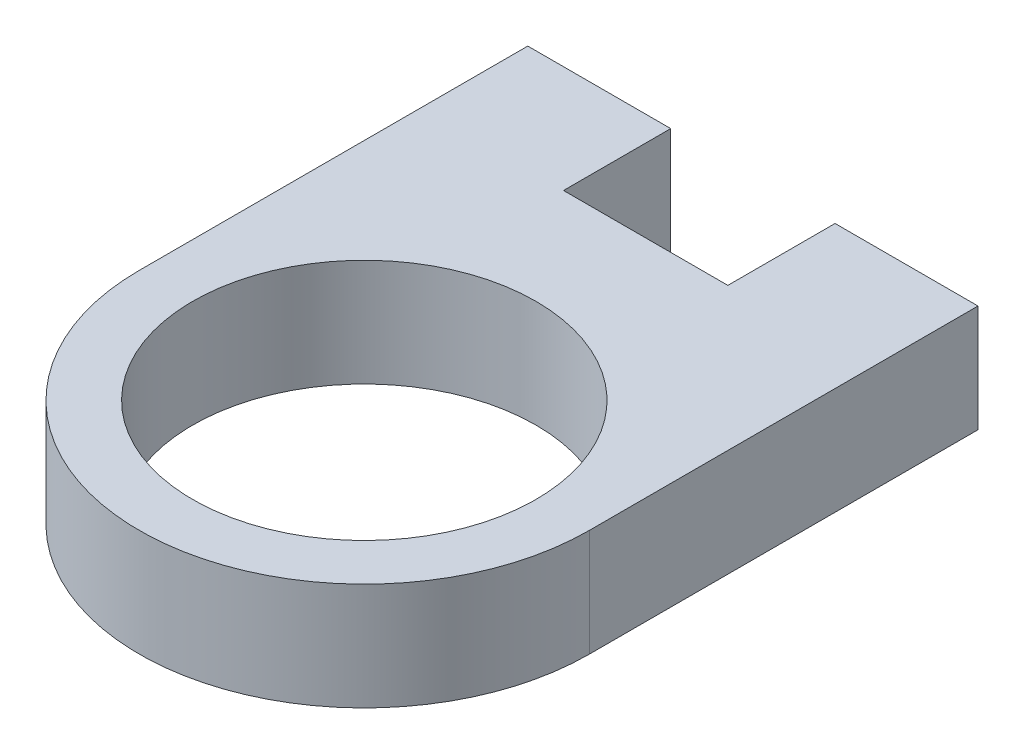
ISO-10303-21;
HEADER;
FILE_DESCRIPTION(('STEP AP214'),'2;1');
FILE_NAME('part.step','',(''),(''),'','','');
FILE_SCHEMA(('AUTOMOTIVE_DESIGN { 1 0 10303 214 1 1 1 1 }'));
ENDSEC;
DATA;
#1=APPLICATION_CONTEXT('core data for automotive mechanical design processes');
#2=APPLICATION_PROTOCOL_DEFINITION('international standard','automotive_design',2000,#1);
#3=PRODUCT_CONTEXT('',#1,'mechanical');
#4=PRODUCT('Part','Part','',(#3));
#5=PRODUCT_RELATED_PRODUCT_CATEGORY('part','',(#4));
#6=PRODUCT_DEFINITION_FORMATION('','',#4);
#7=PRODUCT_DEFINITION_CONTEXT('part definition',#1,'design');
#8=PRODUCT_DEFINITION('design','',#6,#7);
#9=PRODUCT_DEFINITION_SHAPE('','',#8);
#10=(LENGTH_UNIT() NAMED_UNIT(*) SI_UNIT(.MILLI.,.METRE.));
#11=(NAMED_UNIT(*) PLANE_ANGLE_UNIT() SI_UNIT($,.RADIAN.));
#12=(NAMED_UNIT(*) SI_UNIT($,.STERADIAN.) SOLID_ANGLE_UNIT());
#13=UNCERTAINTY_MEASURE_WITH_UNIT(LENGTH_MEASURE(1.E-05),#10,'distance_accuracy_value','');
#14=(GEOMETRIC_REPRESENTATION_CONTEXT(3) GLOBAL_UNCERTAINTY_ASSIGNED_CONTEXT((#13)) GLOBAL_UNIT_ASSIGNED_CONTEXT((#10,
#11,#12)) REPRESENTATION_CONTEXT('',''));
#15=CARTESIAN_POINT('',(0.,0.,0.));
#16=DIRECTION('',(0.,0.,1.));
#17=DIRECTION('',(1.,0.,0.));
#18=AXIS2_PLACEMENT_3D('',#15,#16,#17);
#19=CARTESIAN_POINT('',(0.,7.62,-20.));
#20=DIRECTION('',(0.,0.,-1.));
#21=DIRECTION('',(-1.,0.,0.));
#22=AXIS2_PLACEMENT_3D('',#19,#20,#21);
#23=PLANE('',#22);
#24=DIRECTION('',(1.,0.,0.));
#25=VECTOR('',#24,1.);
#26=CARTESIAN_POINT('',(0.,0.,-20.));
#27=LINE('',#26,#25);
#28=CARTESIAN_POINT('',(10.16,0.,-20.));
#29=VERTEX_POINT('',#28);
#30=CARTESIAN_POINT('',(21.84,0.,-20.));
#31=VERTEX_POINT('',#30);
#32=EDGE_CURVE('E65',#29,#31,#27,.T.);
#33=ORIENTED_EDGE('',*,*,#32,.F.);
#34=DIRECTION('',(0.,-1.,0.));
#35=VECTOR('',#34,1.);
#36=CARTESIAN_POINT('',(10.16,7.62,-20.));
#37=LINE('',#36,#35);
#38=CARTESIAN_POINT('',(10.16,7.62,-20.));
#39=VERTEX_POINT('',#38);
#40=EDGE_CURVE('E134',#39,#29,#37,.T.);
#41=ORIENTED_EDGE('',*,*,#40,.F.);
#42=DIRECTION('',(1.,0.,0.));
#43=VECTOR('',#42,1.);
#44=CARTESIAN_POINT('',(0.,7.62,-20.));
#45=LINE('',#44,#43);
#46=CARTESIAN_POINT('',(21.84,7.62,-20.));
#47=VERTEX_POINT('',#46);
#48=EDGE_CURVE('E120',#39,#47,#45,.T.);
#49=ORIENTED_EDGE('',*,*,#48,.T.);
#50=DIRECTION('',(0.,1.,0.));
#51=VECTOR('',#50,1.);
#52=CARTESIAN_POINT('',(21.84,7.62,-20.));
#53=LINE('',#52,#51);
#54=EDGE_CURVE('E142',#31,#47,#53,.T.);
#55=ORIENTED_EDGE('',*,*,#54,.F.);
#56=EDGE_LOOP('',(#33,#41,#49,#55));
#57=FACE_BOUND('',#56,.T.);
#58=ADVANCED_FACE('F45',(#57),#23,.T.);
#59=CARTESIAN_POINT('',(16.,7.62,0.));
#60=DIRECTION('',(0.,-1.,0.));
#61=DIRECTION('',(0.,0.,-1.));
#62=AXIS2_PLACEMENT_3D('',#59,#60,#61);
#63=CYLINDRICAL_SURFACE('',#62,16.);
#64=CARTESIAN_POINT('',(16.,0.,0.));
#65=DIRECTION('',(0.,1.,0.));
#66=DIRECTION('',(0.,0.,1.));
#67=AXIS2_PLACEMENT_3D('',#64,#65,#66);
#68=CIRCLE('',#67,16.);
#69=CARTESIAN_POINT('',(0.,0.,0.));
#70=VERTEX_POINT('',#69);
#71=CARTESIAN_POINT('',(32.,0.,0.));
#72=VERTEX_POINT('',#71);
#73=EDGE_CURVE('E165',#70,#72,#68,.T.);
#74=ORIENTED_EDGE('',*,*,#73,.T.);
#75=DIRECTION('',(0.,-1.,0.));
#76=VECTOR('',#75,1.);
#77=CARTESIAN_POINT('',(32.,7.62,0.));
#78=LINE('',#77,#76);
#79=CARTESIAN_POINT('',(32.,7.62,0.));
#80=VERTEX_POINT('',#79);
#81=EDGE_CURVE('E13',#80,#72,#78,.T.);
#82=ORIENTED_EDGE('',*,*,#81,.F.);
#83=CARTESIAN_POINT('',(16.,7.62,0.));
#84=DIRECTION('',(0.,1.,0.));
#85=DIRECTION('',(0.,0.,1.));
#86=AXIS2_PLACEMENT_3D('',#83,#84,#85);
#87=CIRCLE('',#86,16.);
#88=CARTESIAN_POINT('',(0.,7.62,0.));
#89=VERTEX_POINT('',#88);
#90=EDGE_CURVE('E168',#89,#80,#87,.T.);
#91=ORIENTED_EDGE('',*,*,#90,.F.);
#92=DIRECTION('',(0.,-1.,0.));
#93=VECTOR('',#92,1.);
#94=CARTESIAN_POINT('',(0.,7.62,0.));
#95=LINE('',#94,#93);
#96=EDGE_CURVE('E53',#89,#70,#95,.T.);
#97=ORIENTED_EDGE('',*,*,#96,.T.);
#98=EDGE_LOOP('',(#74,#82,#91,#97));
#99=FACE_BOUND('',#98,.T.);
#100=ADVANCED_FACE('F47',(#99),#63,.T.);
#101=CARTESIAN_POINT('',(32.,7.62,0.));
#102=DIRECTION('',(-1.,0.,0.));
#103=DIRECTION('',(0.,0.,1.));
#104=AXIS2_PLACEMENT_3D('',#101,#102,#103);
#105=PLANE('',#104);
#106=DIRECTION('',(0.,0.,-1.));
#107=VECTOR('',#106,1.);
#108=CARTESIAN_POINT('',(32.,0.,0.));
#109=LINE('',#108,#107);
#110=CARTESIAN_POINT('',(32.,0.,-27.62));
#111=VERTEX_POINT('',#110);
#112=EDGE_CURVE('E176',#72,#111,#109,.T.);
#113=ORIENTED_EDGE('',*,*,#112,.T.);
#114=DIRECTION('',(0.,-1.,0.));
#115=VECTOR('',#114,1.);
#116=CARTESIAN_POINT('',(32.,7.62,-27.62));
#117=LINE('',#116,#115);
#118=CARTESIAN_POINT('',(32.,7.62,-27.62));
#119=VERTEX_POINT('',#118);
#120=EDGE_CURVE('E143',#119,#111,#117,.T.);
#121=ORIENTED_EDGE('',*,*,#120,.F.);
#122=DIRECTION('',(0.,0.,-1.));
#123=VECTOR('',#122,1.);
#124=CARTESIAN_POINT('',(32.,7.62,0.));
#125=LINE('',#124,#123);
#126=EDGE_CURVE('E170',#80,#119,#125,.T.);
#127=ORIENTED_EDGE('',*,*,#126,.F.);
#128=ORIENTED_EDGE('',*,*,#81,.T.);
#129=EDGE_LOOP('',(#113,#121,#127,#128));
#130=FACE_BOUND('',#129,.T.);
#131=ADVANCED_FACE('F186',(#130),#105,.F.);
#132=CARTESIAN_POINT('',(0.,7.62,0.));
#133=DIRECTION('',(-1.,0.,0.));
#134=DIRECTION('',(0.,0.,1.));
#135=AXIS2_PLACEMENT_3D('',#132,#133,#134);
#136=PLANE('',#135);
#137=DIRECTION('',(0.,0.,-1.));
#138=VECTOR('',#137,1.);
#139=CARTESIAN_POINT('',(0.,0.,0.));
#140=LINE('',#139,#138);
#141=CARTESIAN_POINT('',(0.,0.,-27.62));
#142=VERTEX_POINT('',#141);
#143=EDGE_CURVE('E171',#70,#142,#140,.T.);
#144=ORIENTED_EDGE('',*,*,#143,.F.);
#145=ORIENTED_EDGE('',*,*,#96,.F.);
#146=DIRECTION('',(0.,0.,-1.));
#147=VECTOR('',#146,1.);
#148=CARTESIAN_POINT('',(0.,7.62,0.));
#149=LINE('',#148,#147);
#150=CARTESIAN_POINT('',(0.,7.62,-27.62));
#151=VERTEX_POINT('',#150);
#152=EDGE_CURVE('E111',#89,#151,#149,.T.);
#153=ORIENTED_EDGE('',*,*,#152,.T.);
#154=DIRECTION('',(0.,1.,0.));
#155=VECTOR('',#154,1.);
#156=CARTESIAN_POINT('',(0.,7.62,-27.62));
#157=LINE('',#156,#155);
#158=EDGE_CURVE('E116',#142,#151,#157,.T.);
#159=ORIENTED_EDGE('',*,*,#158,.F.);
#160=EDGE_LOOP('',(#144,#145,#153,#159));
#161=FACE_BOUND('',#160,.T.);
#162=ADVANCED_FACE('F114',(#161),#136,.T.);
#163=CARTESIAN_POINT('',(16.,7.62,0.));
#164=DIRECTION('',(0.,1.,0.));
#165=DIRECTION('',(0.,0.,1.));
#166=AXIS2_PLACEMENT_3D('',#163,#164,#165);
#167=PLANE('',#166);
#168=CARTESIAN_POINT('',(16.,7.62,0.));
#169=DIRECTION('',(0.,-1.,0.));
#170=DIRECTION('',(0.,0.,-1.));
#171=AXIS2_PLACEMENT_3D('',#168,#169,#170);
#172=CIRCLE('',#171,12.2);
#173=CARTESIAN_POINT('',(16.,7.62,-12.2));
#174=VERTEX_POINT('',#173);
#175=EDGE_CURVE('E162',#174,#174,#172,.T.);
#176=ORIENTED_EDGE('',*,*,#175,.T.);
#177=EDGE_LOOP('',(#176));
#178=FACE_BOUND('',#177,.T.);
#179=ORIENTED_EDGE('',*,*,#90,.T.);
#180=ORIENTED_EDGE('',*,*,#126,.T.);
#181=DIRECTION('',(1.,0.,0.));
#182=VECTOR('',#181,1.);
#183=CARTESIAN_POINT('',(32.,7.62,-27.62));
#184=LINE('',#183,#182);
#185=CARTESIAN_POINT('',(21.84,7.62,-27.62));
#186=VERTEX_POINT('',#185);
#187=EDGE_CURVE('E150',#186,#119,#184,.T.);
#188=ORIENTED_EDGE('',*,*,#187,.F.);
#189=DIRECTION('',(0.,0.,1.));
#190=VECTOR('',#189,1.);
#191=CARTESIAN_POINT('',(21.84,7.62,-27.62));
#192=LINE('',#191,#190);
#193=EDGE_CURVE('E153',#186,#47,#192,.T.);
#194=ORIENTED_EDGE('',*,*,#193,.T.);
#195=ORIENTED_EDGE('',*,*,#48,.F.);
#196=DIRECTION('',(0.,0.,1.));
#197=VECTOR('',#196,1.);
#198=CARTESIAN_POINT('',(10.16,7.62,-27.62));
#199=LINE('',#198,#197);
#200=CARTESIAN_POINT('',(10.16,7.62,-27.62));
#201=VERTEX_POINT('',#200);
#202=EDGE_CURVE('E126',#201,#39,#199,.T.);
#203=ORIENTED_EDGE('',*,*,#202,.F.);
#204=DIRECTION('',(1.,0.,0.));
#205=VECTOR('',#204,1.);
#206=CARTESIAN_POINT('',(0.,7.62,-27.62));
#207=LINE('',#206,#205);
#208=EDGE_CURVE('E123',#151,#201,#207,.T.);
#209=ORIENTED_EDGE('',*,*,#208,.F.);
#210=ORIENTED_EDGE('',*,*,#152,.F.);
#211=EDGE_LOOP('',(#179,#180,#188,#194,#195,#203,#209,#210));
#212=FACE_BOUND('',#211,.T.);
#213=ADVANCED_FACE('F124',(#178,#212),#167,.T.);
#214=CARTESIAN_POINT('',(16.,0.,0.));
#215=DIRECTION('',(0.,1.,0.));
#216=DIRECTION('',(0.,0.,1.));
#217=AXIS2_PLACEMENT_3D('',#214,#215,#216);
#218=PLANE('',#217);
#219=CARTESIAN_POINT('',(16.,0.,0.));
#220=DIRECTION('',(0.,-1.,0.));
#221=DIRECTION('',(0.,0.,-1.));
#222=AXIS2_PLACEMENT_3D('',#219,#220,#221);
#223=CIRCLE('',#222,12.2);
#224=CARTESIAN_POINT('',(16.,0.,-12.2));
#225=VERTEX_POINT('',#224);
#226=EDGE_CURVE('E161',#225,#225,#223,.T.);
#227=ORIENTED_EDGE('',*,*,#226,.F.);
#228=EDGE_LOOP('',(#227));
#229=FACE_BOUND('',#228,.T.);
#230=ORIENTED_EDGE('',*,*,#73,.F.);
#231=ORIENTED_EDGE('',*,*,#143,.T.);
#232=DIRECTION('',(-1.,0.,0.));
#233=VECTOR('',#232,1.);
#234=CARTESIAN_POINT('',(0.,0.,-27.62));
#235=LINE('',#234,#233);
#236=CARTESIAN_POINT('',(10.16,0.,-27.62));
#237=VERTEX_POINT('',#236);
#238=EDGE_CURVE('E133',#237,#142,#235,.T.);
#239=ORIENTED_EDGE('',*,*,#238,.F.);
#240=DIRECTION('',(0.,0.,1.));
#241=VECTOR('',#240,1.);
#242=CARTESIAN_POINT('',(10.16,0.,-27.62));
#243=LINE('',#242,#241);
#244=EDGE_CURVE('E60',#237,#29,#243,.T.);
#245=ORIENTED_EDGE('',*,*,#244,.T.);
#246=ORIENTED_EDGE('',*,*,#32,.T.);
#247=DIRECTION('',(0.,0.,1.));
#248=VECTOR('',#247,1.);
#249=CARTESIAN_POINT('',(21.84,0.,-27.62));
#250=LINE('',#249,#248);
#251=CARTESIAN_POINT('',(21.84,0.,-27.62));
#252=VERTEX_POINT('',#251);
#253=EDGE_CURVE('E158',#252,#31,#250,.T.);
#254=ORIENTED_EDGE('',*,*,#253,.F.);
#255=DIRECTION('',(-1.,0.,0.));
#256=VECTOR('',#255,1.);
#257=CARTESIAN_POINT('',(32.,0.,-27.62));
#258=LINE('',#257,#256);
#259=EDGE_CURVE('E146',#111,#252,#258,.T.);
#260=ORIENTED_EDGE('',*,*,#259,.F.);
#261=ORIENTED_EDGE('',*,*,#112,.F.);
#262=EDGE_LOOP('',(#230,#231,#239,#245,#246,#254,#260,#261));
#263=FACE_BOUND('',#262,.T.);
#264=ADVANCED_FACE('F182',(#229,#263),#218,.F.);
#265=CARTESIAN_POINT('',(16.,7.62,0.));
#266=DIRECTION('',(0.,-1.,0.));
#267=DIRECTION('',(0.,0.,-1.));
#268=AXIS2_PLACEMENT_3D('',#265,#266,#267);
#269=CYLINDRICAL_SURFACE('',#268,12.2);
#270=ORIENTED_EDGE('',*,*,#175,.F.);
#271=EDGE_LOOP('',(#270));
#272=FACE_BOUND('',#271,.T.);
#273=ORIENTED_EDGE('',*,*,#226,.T.);
#274=EDGE_LOOP('',(#273));
#275=FACE_BOUND('',#274,.T.);
#276=ADVANCED_FACE('F225',(#272,#275),#269,.F.);
#277=CARTESIAN_POINT('',(21.84,7.62,-27.62));
#278=DIRECTION('',(1.,0.,0.));
#279=DIRECTION('',(0.,0.,-1.));
#280=AXIS2_PLACEMENT_3D('',#277,#278,#279);
#281=PLANE('',#280);
#282=ORIENTED_EDGE('',*,*,#54,.T.);
#283=ORIENTED_EDGE('',*,*,#193,.F.);
#284=DIRECTION('',(0.,1.,0.));
#285=VECTOR('',#284,1.);
#286=CARTESIAN_POINT('',(21.84,7.62,-27.62));
#287=LINE('',#286,#285);
#288=EDGE_CURVE('E148',#252,#186,#287,.T.);
#289=ORIENTED_EDGE('',*,*,#288,.F.);
#290=ORIENTED_EDGE('',*,*,#253,.T.);
#291=EDGE_LOOP('',(#282,#283,#289,#290));
#292=FACE_BOUND('',#291,.T.);
#293=ADVANCED_FACE('F193',(#292),#281,.F.);
#294=CARTESIAN_POINT('',(0.,0.,-27.62));
#295=DIRECTION('',(0.,0.,-1.));
#296=DIRECTION('',(-1.,0.,0.));
#297=AXIS2_PLACEMENT_3D('',#294,#295,#296);
#298=PLANE('',#297);
#299=ORIENTED_EDGE('',*,*,#120,.T.);
#300=ORIENTED_EDGE('',*,*,#259,.T.);
#301=ORIENTED_EDGE('',*,*,#288,.T.);
#302=ORIENTED_EDGE('',*,*,#187,.T.);
#303=EDGE_LOOP('',(#299,#300,#301,#302));
#304=FACE_BOUND('',#303,.T.);
#305=ADVANCED_FACE('F189',(#304),#298,.T.);
#306=CARTESIAN_POINT('',(10.16,7.62,-27.62));
#307=DIRECTION('',(-1.,0.,0.));
#308=DIRECTION('',(0.,0.,1.));
#309=AXIS2_PLACEMENT_3D('',#306,#307,#308);
#310=PLANE('',#309);
#311=ORIENTED_EDGE('',*,*,#40,.T.);
#312=ORIENTED_EDGE('',*,*,#244,.F.);
#313=DIRECTION('',(0.,-1.,0.));
#314=VECTOR('',#313,1.);
#315=CARTESIAN_POINT('',(10.16,7.62,-27.62));
#316=LINE('',#315,#314);
#317=EDGE_CURVE('E129',#201,#237,#316,.T.);
#318=ORIENTED_EDGE('',*,*,#317,.F.);
#319=ORIENTED_EDGE('',*,*,#202,.T.);
#320=EDGE_LOOP('',(#311,#312,#318,#319));
#321=FACE_BOUND('',#320,.T.);
#322=ADVANCED_FACE('F197',(#321),#310,.F.);
#323=CARTESIAN_POINT('',(0.,0.,-27.62));
#324=DIRECTION('',(0.,0.,1.));
#325=DIRECTION('',(1.,0.,0.));
#326=AXIS2_PLACEMENT_3D('',#323,#324,#325);
#327=PLANE('',#326);
#328=ORIENTED_EDGE('',*,*,#158,.T.);
#329=ORIENTED_EDGE('',*,*,#208,.T.);
#330=ORIENTED_EDGE('',*,*,#317,.T.);
#331=ORIENTED_EDGE('',*,*,#238,.T.);
#332=EDGE_LOOP('',(#328,#329,#330,#331));
#333=FACE_BOUND('',#332,.T.);
#334=ADVANCED_FACE('F132',(#333),#327,.F.);
#335=CLOSED_SHELL('',(#58,#100,#131,#162,#213,#264,#276,#293,#305,#322,#334));
#336=MANIFOLD_SOLID_BREP('B2',#335);
#337=ADVANCED_BREP_SHAPE_REPRESENTATION('',(#18,#336),#14);
#338=SHAPE_DEFINITION_REPRESENTATION(#9,#337);
ENDSEC;
END-ISO-10303-21;
